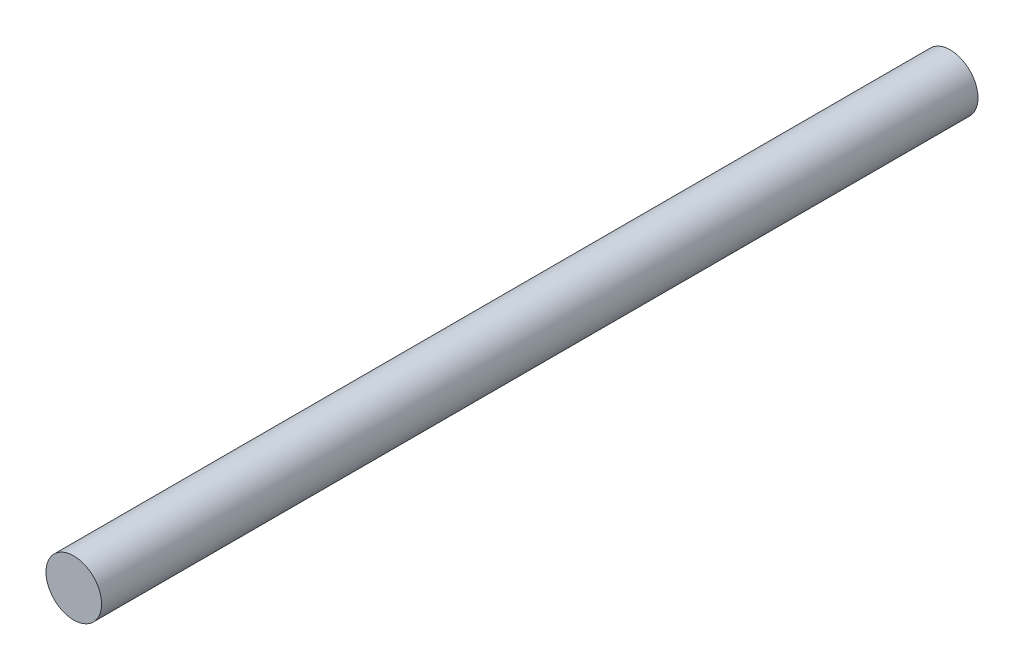
ISO-10303-21;
HEADER;
FILE_DESCRIPTION(('STEP AP214'),'2;1');
FILE_NAME('part.step','',(''),(''),'','','');
FILE_SCHEMA(('AUTOMOTIVE_DESIGN { 1 0 10303 214 1 1 1 1 }'));
ENDSEC;
DATA;
#1=APPLICATION_CONTEXT('core data for automotive mechanical design processes');
#2=APPLICATION_PROTOCOL_DEFINITION('international standard','automotive_design',2000,#1);
#3=PRODUCT_CONTEXT('',#1,'mechanical');
#4=PRODUCT('Part','Part','',(#3));
#5=PRODUCT_RELATED_PRODUCT_CATEGORY('part','',(#4));
#6=PRODUCT_DEFINITION_FORMATION('','',#4);
#7=PRODUCT_DEFINITION_CONTEXT('part definition',#1,'design');
#8=PRODUCT_DEFINITION('design','',#6,#7);
#9=PRODUCT_DEFINITION_SHAPE('','',#8);
#10=(LENGTH_UNIT() NAMED_UNIT(*) SI_UNIT(.MILLI.,.METRE.));
#11=(NAMED_UNIT(*) PLANE_ANGLE_UNIT() SI_UNIT($,.RADIAN.));
#12=(NAMED_UNIT(*) SI_UNIT($,.STERADIAN.) SOLID_ANGLE_UNIT());
#13=UNCERTAINTY_MEASURE_WITH_UNIT(LENGTH_MEASURE(1.E-05),#10,'distance_accuracy_value','');
#14=(GEOMETRIC_REPRESENTATION_CONTEXT(3) GLOBAL_UNCERTAINTY_ASSIGNED_CONTEXT((#13)) GLOBAL_UNIT_ASSIGNED_CONTEXT((#10,
#11,#12)) REPRESENTATION_CONTEXT('',''));
#15=CARTESIAN_POINT('',(0.,0.,0.));
#16=DIRECTION('',(0.,0.,1.));
#17=DIRECTION('',(1.,0.,0.));
#18=AXIS2_PLACEMENT_3D('',#15,#16,#17);
#19=CARTESIAN_POINT('',(0.,0.,93.));
#20=DIRECTION('',(0.,0.,-1.));
#21=DIRECTION('',(-1.,0.,0.));
#22=AXIS2_PLACEMENT_3D('',#19,#20,#21);
#23=CYLINDRICAL_SURFACE('',#22,2.95);
#24=CARTESIAN_POINT('',(0.,0.,93.));
#25=DIRECTION('',(0.,0.,1.));
#26=DIRECTION('',(1.,0.,0.));
#27=AXIS2_PLACEMENT_3D('',#24,#25,#26);
#28=CIRCLE('',#27,2.95);
#29=CARTESIAN_POINT('',(2.95,0.,93.));
#30=VERTEX_POINT('',#29);
#31=EDGE_CURVE('E10',#30,#30,#28,.T.);
#32=ORIENTED_EDGE('',*,*,#31,.F.);
#33=EDGE_LOOP('',(#32));
#34=FACE_BOUND('',#33,.T.);
#35=CARTESIAN_POINT('',(0.,0.,0.));
#36=DIRECTION('',(0.,0.,1.));
#37=DIRECTION('',(1.,0.,0.));
#38=AXIS2_PLACEMENT_3D('',#35,#36,#37);
#39=CIRCLE('',#38,2.95);
#40=CARTESIAN_POINT('',(2.95,0.,0.));
#41=VERTEX_POINT('',#40);
#42=EDGE_CURVE('E33',#41,#41,#39,.T.);
#43=ORIENTED_EDGE('',*,*,#42,.T.);
#44=EDGE_LOOP('',(#43));
#45=FACE_BOUND('',#44,.T.);
#46=ADVANCED_FACE('F30',(#34,#45),#23,.T.);
#47=CARTESIAN_POINT('',(0.,0.,93.));
#48=DIRECTION('',(0.,0.,1.));
#49=DIRECTION('',(1.,0.,0.));
#50=AXIS2_PLACEMENT_3D('',#47,#48,#49);
#51=PLANE('',#50);
#52=ORIENTED_EDGE('',*,*,#31,.T.);
#53=EDGE_LOOP('',(#52));
#54=FACE_BOUND('',#53,.T.);
#55=ADVANCED_FACE('F45',(#54),#51,.T.);
#56=CARTESIAN_POINT('',(0.,0.,0.));
#57=DIRECTION('',(0.,0.,1.));
#58=DIRECTION('',(1.,0.,0.));
#59=AXIS2_PLACEMENT_3D('',#56,#57,#58);
#60=PLANE('',#59);
#61=ORIENTED_EDGE('',*,*,#42,.F.);
#62=EDGE_LOOP('',(#61));
#63=FACE_BOUND('',#62,.T.);
#64=ADVANCED_FACE('F43',(#63),#60,.F.);
#65=CLOSED_SHELL('',(#46,#55,#64));
#66=MANIFOLD_SOLID_BREP('B2',#65);
#67=ADVANCED_BREP_SHAPE_REPRESENTATION('',(#18,#66),#14);
#68=SHAPE_DEFINITION_REPRESENTATION(#9,#67);
ENDSEC;
END-ISO-10303-21;
